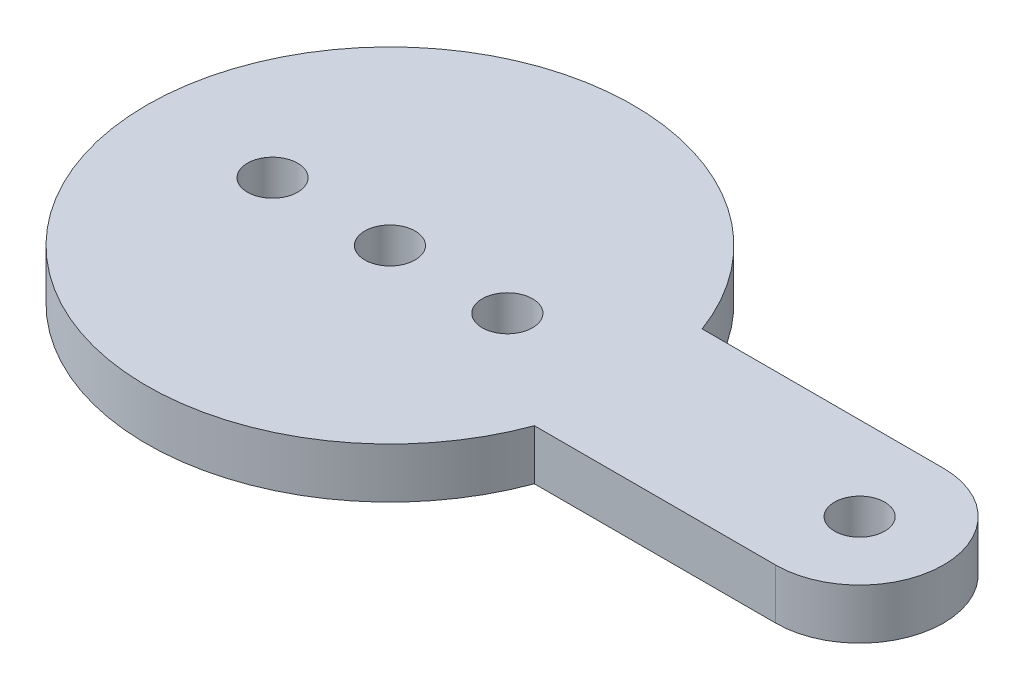
ISO-10303-21;
HEADER;
FILE_DESCRIPTION(('STEP AP214'),'2;1');
FILE_NAME('part.step','',(''),(''),'','','');
FILE_SCHEMA(('AUTOMOTIVE_DESIGN { 1 0 10303 214 1 1 1 1 }'));
ENDSEC;
DATA;
#1=APPLICATION_CONTEXT('core data for automotive mechanical design processes');
#2=APPLICATION_PROTOCOL_DEFINITION('international standard','automotive_design',2000,#1);
#3=PRODUCT_CONTEXT('',#1,'mechanical');
#4=PRODUCT('Part','Part','',(#3));
#5=PRODUCT_RELATED_PRODUCT_CATEGORY('part','',(#4));
#6=PRODUCT_DEFINITION_FORMATION('','',#4);
#7=PRODUCT_DEFINITION_CONTEXT('part definition',#1,'design');
#8=PRODUCT_DEFINITION('design','',#6,#7);
#9=PRODUCT_DEFINITION_SHAPE('','',#8);
#10=(LENGTH_UNIT() NAMED_UNIT(*) SI_UNIT(.MILLI.,.METRE.));
#11=(NAMED_UNIT(*) PLANE_ANGLE_UNIT() SI_UNIT($,.RADIAN.));
#12=(NAMED_UNIT(*) SI_UNIT($,.STERADIAN.) SOLID_ANGLE_UNIT());
#13=UNCERTAINTY_MEASURE_WITH_UNIT(LENGTH_MEASURE(1.E-05),#10,'distance_accuracy_value','');
#14=(GEOMETRIC_REPRESENTATION_CONTEXT(3) GLOBAL_UNCERTAINTY_ASSIGNED_CONTEXT((#13)) GLOBAL_UNIT_ASSIGNED_CONTEXT((#10,
#11,#12)) REPRESENTATION_CONTEXT('',''));
#15=CARTESIAN_POINT('',(0.,0.,0.));
#16=DIRECTION('',(0.,0.,1.));
#17=DIRECTION('',(1.,0.,0.));
#18=AXIS2_PLACEMENT_3D('',#15,#16,#17);
#19=CARTESIAN_POINT('',(28.,3.,0.));
#20=DIRECTION('',(0.,1.,0.));
#21=DIRECTION('',(0.,0.,1.));
#22=AXIS2_PLACEMENT_3D('',#19,#20,#21);
#23=PLANE('',#22);
#24=CARTESIAN_POINT('',(7.,3.,0.));
#25=DIRECTION('',(0.,1.,0.));
#26=DIRECTION('',(0.,0.,1.));
#27=AXIS2_PLACEMENT_3D('',#24,#25,#26);
#28=CIRCLE('',#27,1.5);
#29=CARTESIAN_POINT('',(7.,3.,1.5));
#30=VERTEX_POINT('',#29);
#31=EDGE_CURVE('E118',#30,#30,#28,.T.);
#32=ORIENTED_EDGE('',*,*,#31,.F.);
#33=EDGE_LOOP('',(#32));
#34=FACE_BOUND('',#33,.T.);
#35=CARTESIAN_POINT('',(28.,3.,0.));
#36=DIRECTION('',(0.,1.,0.));
#37=DIRECTION('',(0.,0.,1.));
#38=AXIS2_PLACEMENT_3D('',#35,#36,#37);
#39=CIRCLE('',#38,1.5);
#40=CARTESIAN_POINT('',(28.,3.,1.5));
#41=VERTEX_POINT('',#40);
#42=EDGE_CURVE('E97',#41,#41,#39,.T.);
#43=ORIENTED_EDGE('',*,*,#42,.F.);
#44=EDGE_LOOP('',(#43));
#45=FACE_BOUND('',#44,.T.);
#46=CARTESIAN_POINT('',(28.,3.,0.));
#47=DIRECTION('',(0.,1.,0.));
#48=DIRECTION('',(0.,0.,1.));
#49=AXIS2_PLACEMENT_3D('',#46,#47,#48);
#50=CIRCLE('',#49,5.);
#51=CARTESIAN_POINT('',(28.,3.,5.));
#52=VERTEX_POINT('',#51);
#53=CARTESIAN_POINT('',(28.,3.,-5.));
#54=VERTEX_POINT('',#53);
#55=EDGE_CURVE('E82',#52,#54,#50,.T.);
#56=ORIENTED_EDGE('',*,*,#55,.T.);
#57=DIRECTION('',(-1.,0.,0.));
#58=VECTOR('',#57,1.);
#59=CARTESIAN_POINT('',(28.,3.,-5.));
#60=LINE('',#59,#58);
#61=CARTESIAN_POINT('',(13.6106575888162,3.,-5.));
#62=VERTEX_POINT('',#61);
#63=EDGE_CURVE('E77',#54,#62,#60,.T.);
#64=ORIENTED_EDGE('',*,*,#63,.T.);
#65=CARTESIAN_POINT('',(0.,3.,0.));
#66=DIRECTION('',(0.,1.,0.));
#67=DIRECTION('',(0.,0.,1.));
#68=AXIS2_PLACEMENT_3D('',#65,#66,#67);
#69=CIRCLE('',#68,14.5);
#70=CARTESIAN_POINT('',(13.6106575888162,3.,5.));
#71=VERTEX_POINT('',#70);
#72=EDGE_CURVE('E80',#62,#71,#69,.T.);
#73=ORIENTED_EDGE('',*,*,#72,.T.);
#74=DIRECTION('',(1.,0.,0.));
#75=VECTOR('',#74,1.);
#76=CARTESIAN_POINT('',(28.,3.,5.));
#77=LINE('',#76,#75);
#78=EDGE_CURVE('E47',#71,#52,#77,.T.);
#79=ORIENTED_EDGE('',*,*,#78,.T.);
#80=EDGE_LOOP('',(#56,#64,#73,#79));
#81=FACE_BOUND('',#80,.T.);
#82=CARTESIAN_POINT('',(0.,3.,0.));
#83=DIRECTION('',(0.,1.,0.));
#84=DIRECTION('',(0.,0.,1.));
#85=AXIS2_PLACEMENT_3D('',#82,#83,#84);
#86=CIRCLE('',#85,1.5);
#87=CARTESIAN_POINT('',(0.,3.,1.5));
#88=VERTEX_POINT('',#87);
#89=EDGE_CURVE('E112',#88,#88,#86,.T.);
#90=ORIENTED_EDGE('',*,*,#89,.F.);
#91=EDGE_LOOP('',(#90));
#92=FACE_BOUND('',#91,.T.);
#93=CARTESIAN_POINT('',(-7.,3.,0.));
#94=DIRECTION('',(0.,1.,0.));
#95=DIRECTION('',(0.,0.,1.));
#96=AXIS2_PLACEMENT_3D('',#93,#94,#95);
#97=CIRCLE('',#96,1.5);
#98=CARTESIAN_POINT('',(-7.,3.,1.5));
#99=VERTEX_POINT('',#98);
#100=EDGE_CURVE('E124',#99,#99,#97,.T.);
#101=ORIENTED_EDGE('',*,*,#100,.F.);
#102=EDGE_LOOP('',(#101));
#103=FACE_BOUND('',#102,.T.);
#104=ADVANCED_FACE('F30',(#34,#45,#81,#92,#103),#23,.T.);
#105=CARTESIAN_POINT('',(28.,0.,0.));
#106=DIRECTION('',(0.,1.,0.));
#107=DIRECTION('',(0.,0.,1.));
#108=AXIS2_PLACEMENT_3D('',#105,#106,#107);
#109=PLANE('',#108);
#110=CARTESIAN_POINT('',(28.,0.,0.));
#111=DIRECTION('',(0.,1.,0.));
#112=DIRECTION('',(0.,0.,1.));
#113=AXIS2_PLACEMENT_3D('',#110,#111,#112);
#114=CIRCLE('',#113,5.);
#115=CARTESIAN_POINT('',(28.,0.,5.));
#116=VERTEX_POINT('',#115);
#117=CARTESIAN_POINT('',(28.,0.,-5.));
#118=VERTEX_POINT('',#117);
#119=EDGE_CURVE('E94',#116,#118,#114,.T.);
#120=ORIENTED_EDGE('',*,*,#119,.F.);
#121=DIRECTION('',(1.,0.,0.));
#122=VECTOR('',#121,1.);
#123=CARTESIAN_POINT('',(28.,0.,5.));
#124=LINE('',#123,#122);
#125=CARTESIAN_POINT('',(13.6106575888162,0.,5.));
#126=VERTEX_POINT('',#125);
#127=EDGE_CURVE('E70',#126,#116,#124,.T.);
#128=ORIENTED_EDGE('',*,*,#127,.F.);
#129=CARTESIAN_POINT('',(0.,0.,0.));
#130=DIRECTION('',(0.,1.,0.));
#131=DIRECTION('',(0.,0.,1.));
#132=AXIS2_PLACEMENT_3D('',#129,#130,#131);
#133=CIRCLE('',#132,14.5);
#134=CARTESIAN_POINT('',(13.6106575888162,0.,-5.));
#135=VERTEX_POINT('',#134);
#136=EDGE_CURVE('E64',#135,#126,#133,.T.);
#137=ORIENTED_EDGE('',*,*,#136,.F.);
#138=DIRECTION('',(-1.,0.,0.));
#139=VECTOR('',#138,1.);
#140=CARTESIAN_POINT('',(28.,0.,-5.));
#141=LINE('',#140,#139);
#142=EDGE_CURVE('E86',#118,#135,#141,.T.);
#143=ORIENTED_EDGE('',*,*,#142,.F.);
#144=EDGE_LOOP('',(#120,#128,#137,#143));
#145=FACE_BOUND('',#144,.T.);
#146=CARTESIAN_POINT('',(28.,0.,0.));
#147=DIRECTION('',(0.,1.,0.));
#148=DIRECTION('',(0.,0.,1.));
#149=AXIS2_PLACEMENT_3D('',#146,#147,#148);
#150=CIRCLE('',#149,1.5);
#151=CARTESIAN_POINT('',(28.,0.,1.5));
#152=VERTEX_POINT('',#151);
#153=EDGE_CURVE('E109',#152,#152,#150,.T.);
#154=ORIENTED_EDGE('',*,*,#153,.T.);
#155=EDGE_LOOP('',(#154));
#156=FACE_BOUND('',#155,.T.);
#157=CARTESIAN_POINT('',(0.,0.,0.));
#158=DIRECTION('',(0.,1.,0.));
#159=DIRECTION('',(0.,0.,1.));
#160=AXIS2_PLACEMENT_3D('',#157,#158,#159);
#161=CIRCLE('',#160,1.5);
#162=CARTESIAN_POINT('',(0.,0.,1.5));
#163=VERTEX_POINT('',#162);
#164=EDGE_CURVE('E115',#163,#163,#161,.T.);
#165=ORIENTED_EDGE('',*,*,#164,.T.);
#166=EDGE_LOOP('',(#165));
#167=FACE_BOUND('',#166,.T.);
#168=CARTESIAN_POINT('',(7.,0.,0.));
#169=DIRECTION('',(0.,1.,0.));
#170=DIRECTION('',(0.,0.,1.));
#171=AXIS2_PLACEMENT_3D('',#168,#169,#170);
#172=CIRCLE('',#171,1.5);
#173=CARTESIAN_POINT('',(7.,0.,1.5));
#174=VERTEX_POINT('',#173);
#175=EDGE_CURVE('E121',#174,#174,#172,.T.);
#176=ORIENTED_EDGE('',*,*,#175,.T.);
#177=EDGE_LOOP('',(#176));
#178=FACE_BOUND('',#177,.T.);
#179=CARTESIAN_POINT('',(-7.,0.,0.));
#180=DIRECTION('',(0.,1.,0.));
#181=DIRECTION('',(0.,0.,1.));
#182=AXIS2_PLACEMENT_3D('',#179,#180,#181);
#183=CIRCLE('',#182,1.5);
#184=CARTESIAN_POINT('',(-7.,0.,1.5));
#185=VERTEX_POINT('',#184);
#186=EDGE_CURVE('E127',#185,#185,#183,.T.);
#187=ORIENTED_EDGE('',*,*,#186,.T.);
#188=EDGE_LOOP('',(#187));
#189=FACE_BOUND('',#188,.T.);
#190=ADVANCED_FACE('F105',(#145,#156,#167,#178,#189),#109,.F.);
#191=CARTESIAN_POINT('',(28.,3.,0.));
#192=DIRECTION('',(0.,-1.,0.));
#193=DIRECTION('',(0.,0.,-1.));
#194=AXIS2_PLACEMENT_3D('',#191,#192,#193);
#195=CYLINDRICAL_SURFACE('',#194,5.);
#196=ORIENTED_EDGE('',*,*,#119,.T.);
#197=DIRECTION('',(0.,-1.,0.));
#198=VECTOR('',#197,1.);
#199=CARTESIAN_POINT('',(28.,3.,-5.));
#200=LINE('',#199,#198);
#201=EDGE_CURVE('E11',#54,#118,#200,.T.);
#202=ORIENTED_EDGE('',*,*,#201,.F.);
#203=ORIENTED_EDGE('',*,*,#55,.F.);
#204=DIRECTION('',(0.,-1.,0.));
#205=VECTOR('',#204,1.);
#206=CARTESIAN_POINT('',(28.,3.,5.));
#207=LINE('',#206,#205);
#208=EDGE_CURVE('E90',#52,#116,#207,.T.);
#209=ORIENTED_EDGE('',*,*,#208,.T.);
#210=EDGE_LOOP('',(#196,#202,#203,#209));
#211=FACE_BOUND('',#210,.T.);
#212=ADVANCED_FACE('F32',(#211),#195,.T.);
#213=CARTESIAN_POINT('',(28.,3.,-5.));
#214=DIRECTION('',(0.,0.,1.));
#215=DIRECTION('',(1.,0.,0.));
#216=AXIS2_PLACEMENT_3D('',#213,#214,#215);
#217=PLANE('',#216);
#218=ORIENTED_EDGE('',*,*,#142,.T.);
#219=DIRECTION('',(0.,-1.,0.));
#220=VECTOR('',#219,1.);
#221=CARTESIAN_POINT('',(13.6106575888162,3.,-5.));
#222=LINE('',#221,#220);
#223=EDGE_CURVE('E39',#62,#135,#222,.T.);
#224=ORIENTED_EDGE('',*,*,#223,.F.);
#225=ORIENTED_EDGE('',*,*,#63,.F.);
#226=ORIENTED_EDGE('',*,*,#201,.T.);
#227=EDGE_LOOP('',(#218,#224,#225,#226));
#228=FACE_BOUND('',#227,.T.);
#229=ADVANCED_FACE('F85',(#228),#217,.F.);
#230=CARTESIAN_POINT('',(0.,3.,0.));
#231=DIRECTION('',(0.,-1.,0.));
#232=DIRECTION('',(0.,0.,-1.));
#233=AXIS2_PLACEMENT_3D('',#230,#231,#232);
#234=CYLINDRICAL_SURFACE('',#233,14.5);
#235=ORIENTED_EDGE('',*,*,#136,.T.);
#236=DIRECTION('',(0.,-1.,0.));
#237=VECTOR('',#236,1.);
#238=CARTESIAN_POINT('',(13.6106575888162,3.,5.));
#239=LINE('',#238,#237);
#240=EDGE_CURVE('E87',#71,#126,#239,.T.);
#241=ORIENTED_EDGE('',*,*,#240,.F.);
#242=ORIENTED_EDGE('',*,*,#72,.F.);
#243=ORIENTED_EDGE('',*,*,#223,.T.);
#244=EDGE_LOOP('',(#235,#241,#242,#243));
#245=FACE_BOUND('',#244,.T.);
#246=ADVANCED_FACE('F88',(#245),#234,.T.);
#247=CARTESIAN_POINT('',(28.,3.,5.));
#248=DIRECTION('',(0.,0.,-1.));
#249=DIRECTION('',(-1.,0.,0.));
#250=AXIS2_PLACEMENT_3D('',#247,#248,#249);
#251=PLANE('',#250);
#252=ORIENTED_EDGE('',*,*,#127,.T.);
#253=ORIENTED_EDGE('',*,*,#208,.F.);
#254=ORIENTED_EDGE('',*,*,#78,.F.);
#255=ORIENTED_EDGE('',*,*,#240,.T.);
#256=EDGE_LOOP('',(#252,#253,#254,#255));
#257=FACE_BOUND('',#256,.T.);
#258=ADVANCED_FACE('F102',(#257),#251,.F.);
#259=CARTESIAN_POINT('',(28.,3.,0.));
#260=DIRECTION('',(0.,-1.,0.));
#261=DIRECTION('',(0.,0.,-1.));
#262=AXIS2_PLACEMENT_3D('',#259,#260,#261);
#263=CYLINDRICAL_SURFACE('',#262,1.5);
#264=ORIENTED_EDGE('',*,*,#42,.T.);
#265=EDGE_LOOP('',(#264));
#266=FACE_BOUND('',#265,.T.);
#267=ORIENTED_EDGE('',*,*,#153,.F.);
#268=EDGE_LOOP('',(#267));
#269=FACE_BOUND('',#268,.T.);
#270=ADVANCED_FACE('F146',(#266,#269),#263,.F.);
#271=CARTESIAN_POINT('',(0.,3.,0.));
#272=DIRECTION('',(0.,-1.,0.));
#273=DIRECTION('',(0.,0.,-1.));
#274=AXIS2_PLACEMENT_3D('',#271,#272,#273);
#275=CYLINDRICAL_SURFACE('',#274,1.5);
#276=ORIENTED_EDGE('',*,*,#89,.T.);
#277=EDGE_LOOP('',(#276));
#278=FACE_BOUND('',#277,.T.);
#279=ORIENTED_EDGE('',*,*,#164,.F.);
#280=EDGE_LOOP('',(#279));
#281=FACE_BOUND('',#280,.T.);
#282=ADVANCED_FACE('F192',(#278,#281),#275,.F.);
#283=CARTESIAN_POINT('',(7.,3.,0.));
#284=DIRECTION('',(0.,-1.,0.));
#285=DIRECTION('',(0.,0.,-1.));
#286=AXIS2_PLACEMENT_3D('',#283,#284,#285);
#287=CYLINDRICAL_SURFACE('',#286,1.5);
#288=ORIENTED_EDGE('',*,*,#31,.T.);
#289=EDGE_LOOP('',(#288));
#290=FACE_BOUND('',#289,.T.);
#291=ORIENTED_EDGE('',*,*,#175,.F.);
#292=EDGE_LOOP('',(#291));
#293=FACE_BOUND('',#292,.T.);
#294=ADVANCED_FACE('F200',(#290,#293),#287,.F.);
#295=CARTESIAN_POINT('',(-7.,3.,0.));
#296=DIRECTION('',(0.,-1.,0.));
#297=DIRECTION('',(0.,0.,-1.));
#298=AXIS2_PLACEMENT_3D('',#295,#296,#297);
#299=CYLINDRICAL_SURFACE('',#298,1.5);
#300=ORIENTED_EDGE('',*,*,#100,.T.);
#301=EDGE_LOOP('',(#300));
#302=FACE_BOUND('',#301,.T.);
#303=ORIENTED_EDGE('',*,*,#186,.F.);
#304=EDGE_LOOP('',(#303));
#305=FACE_BOUND('',#304,.T.);
#306=ADVANCED_FACE('F133',(#302,#305),#299,.F.);
#307=CLOSED_SHELL('',(#104,#190,#212,#229,#246,#258,#270,#282,#294,#306));
#308=MANIFOLD_SOLID_BREP('B2',#307);
#309=ADVANCED_BREP_SHAPE_REPRESENTATION('',(#18,#308),#14);
#310=SHAPE_DEFINITION_REPRESENTATION(#9,#309);
ENDSEC;
END-ISO-10303-21;
